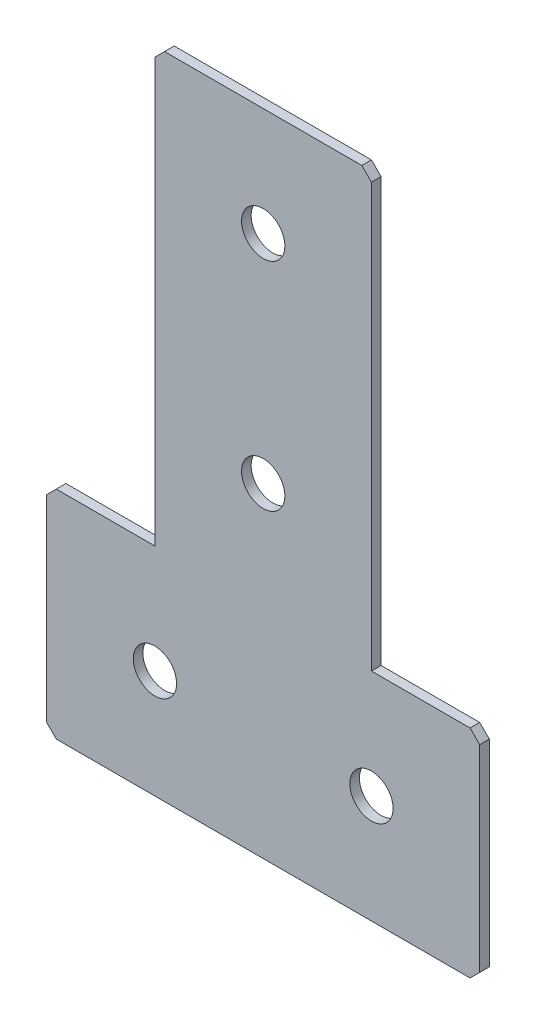
ISO-10303-21;
HEADER;
FILE_DESCRIPTION(('STEP AP214'),'2;1');
FILE_NAME('part.step','',(''),(''),'','','');
FILE_SCHEMA(('AUTOMOTIVE_DESIGN { 1 0 10303 214 1 1 1 1 }'));
ENDSEC;
DATA;
#1=APPLICATION_CONTEXT('core data for automotive mechanical design processes');
#2=APPLICATION_PROTOCOL_DEFINITION('international standard','automotive_design',2000,#1);
#3=PRODUCT_CONTEXT('',#1,'mechanical');
#4=PRODUCT('Part','Part','',(#3));
#5=PRODUCT_RELATED_PRODUCT_CATEGORY('part','',(#4));
#6=PRODUCT_DEFINITION_FORMATION('','',#4);
#7=PRODUCT_DEFINITION_CONTEXT('part definition',#1,'design');
#8=PRODUCT_DEFINITION('design','',#6,#7);
#9=PRODUCT_DEFINITION_SHAPE('','',#8);
#10=(LENGTH_UNIT() NAMED_UNIT(*) SI_UNIT(.MILLI.,.METRE.));
#11=(NAMED_UNIT(*) PLANE_ANGLE_UNIT() SI_UNIT($,.RADIAN.));
#12=(NAMED_UNIT(*) SI_UNIT($,.STERADIAN.) SOLID_ANGLE_UNIT());
#13=UNCERTAINTY_MEASURE_WITH_UNIT(LENGTH_MEASURE(1.E-05),#10,'distance_accuracy_value','');
#14=(GEOMETRIC_REPRESENTATION_CONTEXT(3) GLOBAL_UNCERTAINTY_ASSIGNED_CONTEXT((#13)) GLOBAL_UNIT_ASSIGNED_CONTEXT((#10,
#11,#12)) REPRESENTATION_CONTEXT('',''));
#15=CARTESIAN_POINT('',(0.,0.,0.));
#16=DIRECTION('',(0.,0.,1.));
#17=DIRECTION('',(1.,0.,0.));
#18=AXIS2_PLACEMENT_3D('',#15,#16,#17);
#19=CARTESIAN_POINT('',(-22.5,-90.,-2.));
#20=DIRECTION('',(1.,0.,0.));
#21=DIRECTION('',(0.,1.,0.));
#22=AXIS2_PLACEMENT_3D('',#19,#20,#21);
#23=PLANE('',#22);
#24=DIRECTION('',(0.,1.,0.));
#25=VECTOR('',#24,1.);
#26=CARTESIAN_POINT('',(-22.5,-90.,0.));
#27=LINE('',#26,#25);
#28=CARTESIAN_POINT('',(-22.5,-90.,0.));
#29=VERTEX_POINT('',#28);
#30=CARTESIAN_POINT('',(-22.5,-2.,0.));
#31=VERTEX_POINT('',#30);
#32=EDGE_CURVE('E178',#29,#31,#27,.T.);
#33=ORIENTED_EDGE('',*,*,#32,.T.);
#34=DIRECTION('',(0.,0.,-1.));
#35=VECTOR('',#34,1.);
#36=CARTESIAN_POINT('',(-22.5,-1.99999999999997,-2.));
#37=LINE('',#36,#35);
#38=CARTESIAN_POINT('',(-22.5,-2.,-2.));
#39=VERTEX_POINT('',#38);
#40=EDGE_CURVE('E240',#31,#39,#37,.T.);
#41=ORIENTED_EDGE('',*,*,#40,.T.);
#42=DIRECTION('',(0.,1.,0.));
#43=VECTOR('',#42,1.);
#44=CARTESIAN_POINT('',(-22.5,-90.,-2.));
#45=LINE('',#44,#43);
#46=CARTESIAN_POINT('',(-22.5,-90.,-2.));
#47=VERTEX_POINT('',#46);
#48=EDGE_CURVE('E198',#47,#39,#45,.T.);
#49=ORIENTED_EDGE('',*,*,#48,.F.);
#50=DIRECTION('',(0.,0.,1.));
#51=VECTOR('',#50,1.);
#52=CARTESIAN_POINT('',(-22.5,-90.,-2.));
#53=LINE('',#52,#51);
#54=EDGE_CURVE('E163',#47,#29,#53,.T.);
#55=ORIENTED_EDGE('',*,*,#54,.T.);
#56=EDGE_LOOP('',(#33,#41,#49,#55));
#57=FACE_BOUND('',#56,.T.);
#58=ADVANCED_FACE('F37',(#57),#23,.F.);
#59=CARTESIAN_POINT('',(22.5,0.,-2.));
#60=DIRECTION('',(0.,-1.,0.));
#61=DIRECTION('',(1.,0.,0.));
#62=AXIS2_PLACEMENT_3D('',#59,#60,#61);
#63=PLANE('',#62);
#64=DIRECTION('',(1.,0.,0.));
#65=VECTOR('',#64,1.);
#66=CARTESIAN_POINT('',(22.5,0.,-2.));
#67=LINE('',#66,#65);
#68=CARTESIAN_POINT('',(-20.5,0.,-2.));
#69=VERTEX_POINT('',#68);
#70=CARTESIAN_POINT('',(20.5,0.,-2.));
#71=VERTEX_POINT('',#70);
#72=EDGE_CURVE('E152',#69,#71,#67,.T.);
#73=ORIENTED_EDGE('',*,*,#72,.F.);
#74=DIRECTION('',(0.,0.,1.));
#75=VECTOR('',#74,1.);
#76=CARTESIAN_POINT('',(-20.5,0.,-2.));
#77=LINE('',#76,#75);
#78=CARTESIAN_POINT('',(-20.5,0.,0.));
#79=VERTEX_POINT('',#78);
#80=EDGE_CURVE('E237',#69,#79,#77,.T.);
#81=ORIENTED_EDGE('',*,*,#80,.T.);
#82=DIRECTION('',(1.,0.,0.));
#83=VECTOR('',#82,1.);
#84=CARTESIAN_POINT('',(22.5,0.,0.));
#85=LINE('',#84,#83);
#86=CARTESIAN_POINT('',(20.5,0.,0.));
#87=VERTEX_POINT('',#86);
#88=EDGE_CURVE('E181',#79,#87,#85,.T.);
#89=ORIENTED_EDGE('',*,*,#88,.T.);
#90=DIRECTION('',(0.,0.,-1.));
#91=VECTOR('',#90,1.);
#92=CARTESIAN_POINT('',(20.5,0.,-2.));
#93=LINE('',#92,#91);
#94=EDGE_CURVE('E235',#87,#71,#93,.T.);
#95=ORIENTED_EDGE('',*,*,#94,.T.);
#96=EDGE_LOOP('',(#73,#81,#89,#95));
#97=FACE_BOUND('',#96,.T.);
#98=ADVANCED_FACE('F288',(#97),#63,.F.);
#99=CARTESIAN_POINT('',(22.5,-90.,-2.));
#100=DIRECTION('',(-1.,0.,0.));
#101=DIRECTION('',(0.,-1.,0.));
#102=AXIS2_PLACEMENT_3D('',#99,#100,#101);
#103=PLANE('',#102);
#104=DIRECTION('',(0.,-1.,0.));
#105=VECTOR('',#104,1.);
#106=CARTESIAN_POINT('',(22.5,-90.,-2.));
#107=LINE('',#106,#105);
#108=CARTESIAN_POINT('',(22.5,-2.00000000000002,-2.));
#109=VERTEX_POINT('',#108);
#110=CARTESIAN_POINT('',(22.5,-90.,-2.));
#111=VERTEX_POINT('',#110);
#112=EDGE_CURVE('E139',#109,#111,#107,.T.);
#113=ORIENTED_EDGE('',*,*,#112,.F.);
#114=DIRECTION('',(0.,0.,1.));
#115=VECTOR('',#114,1.);
#116=CARTESIAN_POINT('',(22.5,-1.99999999999999,-2.));
#117=LINE('',#116,#115);
#118=CARTESIAN_POINT('',(22.5,-2.00000000000002,0.));
#119=VERTEX_POINT('',#118);
#120=EDGE_CURVE('E242',#109,#119,#117,.T.);
#121=ORIENTED_EDGE('',*,*,#120,.T.);
#122=DIRECTION('',(0.,-1.,0.));
#123=VECTOR('',#122,1.);
#124=CARTESIAN_POINT('',(22.5,-90.,0.));
#125=LINE('',#124,#123);
#126=CARTESIAN_POINT('',(22.5,-90.,0.));
#127=VERTEX_POINT('',#126);
#128=EDGE_CURVE('E158',#119,#127,#125,.T.);
#129=ORIENTED_EDGE('',*,*,#128,.T.);
#130=DIRECTION('',(0.,0.,1.));
#131=VECTOR('',#130,1.);
#132=CARTESIAN_POINT('',(22.5,-90.,-2.));
#133=LINE('',#132,#131);
#134=EDGE_CURVE('E155',#111,#127,#133,.T.);
#135=ORIENTED_EDGE('',*,*,#134,.F.);
#136=EDGE_LOOP('',(#113,#121,#129,#135));
#137=FACE_BOUND('',#136,.T.);
#138=ADVANCED_FACE('F156',(#137),#103,.F.);
#139=CARTESIAN_POINT('',(45.,-90.,-2.));
#140=DIRECTION('',(0.,-1.,0.));
#141=DIRECTION('',(1.,0.,0.));
#142=AXIS2_PLACEMENT_3D('',#139,#140,#141);
#143=PLANE('',#142);
#144=DIRECTION('',(1.,0.,0.));
#145=VECTOR('',#144,1.);
#146=CARTESIAN_POINT('',(45.,-90.,0.));
#147=LINE('',#146,#145);
#148=CARTESIAN_POINT('',(43.,-90.,0.));
#149=VERTEX_POINT('',#148);
#150=EDGE_CURVE('E186',#127,#149,#147,.T.);
#151=ORIENTED_EDGE('',*,*,#150,.T.);
#152=DIRECTION('',(0.,0.,-1.));
#153=VECTOR('',#152,1.);
#154=CARTESIAN_POINT('',(43.,-90.,-2.));
#155=LINE('',#154,#153);
#156=CARTESIAN_POINT('',(43.,-90.,-2.));
#157=VERTEX_POINT('',#156);
#158=EDGE_CURVE('E11',#149,#157,#155,.T.);
#159=ORIENTED_EDGE('',*,*,#158,.T.);
#160=DIRECTION('',(1.,0.,0.));
#161=VECTOR('',#160,1.);
#162=CARTESIAN_POINT('',(45.,-90.,-2.));
#163=LINE('',#162,#161);
#164=EDGE_CURVE('E144',#111,#157,#163,.T.);
#165=ORIENTED_EDGE('',*,*,#164,.F.);
#166=ORIENTED_EDGE('',*,*,#134,.T.);
#167=EDGE_LOOP('',(#151,#159,#165,#166));
#168=FACE_BOUND('',#167,.T.);
#169=ADVANCED_FACE('F165',(#168),#143,.F.);
#170=CARTESIAN_POINT('',(45.,-135.,-2.));
#171=DIRECTION('',(-1.,0.,0.));
#172=DIRECTION('',(0.,0.,1.));
#173=AXIS2_PLACEMENT_3D('',#170,#171,#172);
#174=PLANE('',#173);
#175=DIRECTION('',(0.,-1.,0.));
#176=VECTOR('',#175,1.);
#177=CARTESIAN_POINT('',(45.,-135.,-2.));
#178=LINE('',#177,#176);
#179=CARTESIAN_POINT('',(45.,-92.,-2.));
#180=VERTEX_POINT('',#179);
#181=CARTESIAN_POINT('',(45.,-133.,-2.));
#182=VERTEX_POINT('',#181);
#183=EDGE_CURVE('E167',#180,#182,#178,.T.);
#184=ORIENTED_EDGE('',*,*,#183,.F.);
#185=DIRECTION('',(0.,0.,1.));
#186=VECTOR('',#185,1.);
#187=CARTESIAN_POINT('',(45.,-92.,-2.));
#188=LINE('',#187,#186);
#189=CARTESIAN_POINT('',(45.,-92.,0.));
#190=VERTEX_POINT('',#189);
#191=EDGE_CURVE('E45',#180,#190,#188,.T.);
#192=ORIENTED_EDGE('',*,*,#191,.T.);
#193=DIRECTION('',(0.,-1.,0.));
#194=VECTOR('',#193,1.);
#195=CARTESIAN_POINT('',(45.,-135.,0.));
#196=LINE('',#195,#194);
#197=CARTESIAN_POINT('',(45.,-133.,0.));
#198=VERTEX_POINT('',#197);
#199=EDGE_CURVE('E188',#190,#198,#196,.T.);
#200=ORIENTED_EDGE('',*,*,#199,.T.);
#201=DIRECTION('',(0.,0.,-1.));
#202=VECTOR('',#201,1.);
#203=CARTESIAN_POINT('',(45.,-133.,-2.));
#204=LINE('',#203,#202);
#205=EDGE_CURVE('E60',#198,#182,#204,.T.);
#206=ORIENTED_EDGE('',*,*,#205,.T.);
#207=EDGE_LOOP('',(#184,#192,#200,#206));
#208=FACE_BOUND('',#207,.T.);
#209=ADVANCED_FACE('F247',(#208),#174,.F.);
#210=CARTESIAN_POINT('',(-45.,-135.,-2.));
#211=DIRECTION('',(0.,1.,0.));
#212=DIRECTION('',(0.,0.,1.));
#213=AXIS2_PLACEMENT_3D('',#210,#211,#212);
#214=PLANE('',#213);
#215=DIRECTION('',(-1.,0.,0.));
#216=VECTOR('',#215,1.);
#217=CARTESIAN_POINT('',(-45.,-135.,0.));
#218=LINE('',#217,#216);
#219=CARTESIAN_POINT('',(43.,-135.,0.));
#220=VERTEX_POINT('',#219);
#221=CARTESIAN_POINT('',(-43.,-135.,0.));
#222=VERTEX_POINT('',#221);
#223=EDGE_CURVE('E190',#220,#222,#218,.T.);
#224=ORIENTED_EDGE('',*,*,#223,.T.);
#225=DIRECTION('',(0.,0.,-1.));
#226=VECTOR('',#225,1.);
#227=CARTESIAN_POINT('',(-43.,-135.,-2.));
#228=LINE('',#227,#226);
#229=CARTESIAN_POINT('',(-43.,-135.,-2.));
#230=VERTEX_POINT('',#229);
#231=EDGE_CURVE('E220',#222,#230,#228,.T.);
#232=ORIENTED_EDGE('',*,*,#231,.T.);
#233=DIRECTION('',(-1.,0.,0.));
#234=VECTOR('',#233,1.);
#235=CARTESIAN_POINT('',(-45.,-135.,-2.));
#236=LINE('',#235,#234);
#237=CARTESIAN_POINT('',(43.,-135.,-2.));
#238=VERTEX_POINT('',#237);
#239=EDGE_CURVE('E169',#238,#230,#236,.T.);
#240=ORIENTED_EDGE('',*,*,#239,.F.);
#241=DIRECTION('',(0.,0.,1.));
#242=VECTOR('',#241,1.);
#243=CARTESIAN_POINT('',(43.,-135.,-2.));
#244=LINE('',#243,#242);
#245=EDGE_CURVE('E217',#238,#220,#244,.T.);
#246=ORIENTED_EDGE('',*,*,#245,.T.);
#247=EDGE_LOOP('',(#224,#232,#240,#246));
#248=FACE_BOUND('',#247,.T.);
#249=ADVANCED_FACE('F258',(#248),#214,.F.);
#250=CARTESIAN_POINT('',(-45.,-135.,-2.));
#251=DIRECTION('',(1.,0.,0.));
#252=DIRECTION('',(0.,1.,0.));
#253=AXIS2_PLACEMENT_3D('',#250,#251,#252);
#254=PLANE('',#253);
#255=DIRECTION('',(0.,1.,0.));
#256=VECTOR('',#255,1.);
#257=CARTESIAN_POINT('',(-45.,-135.,-2.));
#258=LINE('',#257,#256);
#259=CARTESIAN_POINT('',(-45.,-133.,-2.));
#260=VERTEX_POINT('',#259);
#261=CARTESIAN_POINT('',(-45.,-92.,-2.));
#262=VERTEX_POINT('',#261);
#263=EDGE_CURVE('E174',#260,#262,#258,.T.);
#264=ORIENTED_EDGE('',*,*,#263,.F.);
#265=DIRECTION('',(0.,0.,1.));
#266=VECTOR('',#265,1.);
#267=CARTESIAN_POINT('',(-45.,-133.,-2.));
#268=LINE('',#267,#266);
#269=CARTESIAN_POINT('',(-45.,-133.,0.));
#270=VERTEX_POINT('',#269);
#271=EDGE_CURVE('E202',#260,#270,#268,.T.);
#272=ORIENTED_EDGE('',*,*,#271,.T.);
#273=DIRECTION('',(0.,1.,0.));
#274=VECTOR('',#273,1.);
#275=CARTESIAN_POINT('',(-45.,-135.,0.));
#276=LINE('',#275,#274);
#277=CARTESIAN_POINT('',(-45.,-92.,0.));
#278=VERTEX_POINT('',#277);
#279=EDGE_CURVE('E193',#270,#278,#276,.T.);
#280=ORIENTED_EDGE('',*,*,#279,.T.);
#281=DIRECTION('',(0.,0.,-1.));
#282=VECTOR('',#281,1.);
#283=CARTESIAN_POINT('',(-45.,-92.,-2.));
#284=LINE('',#283,#282);
#285=EDGE_CURVE('E162',#278,#262,#284,.T.);
#286=ORIENTED_EDGE('',*,*,#285,.T.);
#287=EDGE_LOOP('',(#264,#272,#280,#286));
#288=FACE_BOUND('',#287,.T.);
#289=ADVANCED_FACE('F266',(#288),#254,.F.);
#290=CARTESIAN_POINT('',(-45.,-90.,-2.));
#291=DIRECTION('',(0.,-1.,0.));
#292=DIRECTION('',(0.,0.,-1.));
#293=AXIS2_PLACEMENT_3D('',#290,#291,#292);
#294=PLANE('',#293);
#295=DIRECTION('',(1.,0.,0.));
#296=VECTOR('',#295,1.);
#297=CARTESIAN_POINT('',(-45.,-90.,-2.));
#298=LINE('',#297,#296);
#299=CARTESIAN_POINT('',(-43.,-90.,-2.));
#300=VERTEX_POINT('',#299);
#301=EDGE_CURVE('E176',#300,#47,#298,.T.);
#302=ORIENTED_EDGE('',*,*,#301,.F.);
#303=DIRECTION('',(0.,0.,1.));
#304=VECTOR('',#303,1.);
#305=CARTESIAN_POINT('',(-43.,-90.,-2.));
#306=LINE('',#305,#304);
#307=CARTESIAN_POINT('',(-43.,-90.,0.));
#308=VERTEX_POINT('',#307);
#309=EDGE_CURVE('E232',#300,#308,#306,.T.);
#310=ORIENTED_EDGE('',*,*,#309,.T.);
#311=DIRECTION('',(1.,0.,0.));
#312=VECTOR('',#311,1.);
#313=CARTESIAN_POINT('',(-45.,-90.,0.));
#314=LINE('',#313,#312);
#315=EDGE_CURVE('E196',#308,#29,#314,.T.);
#316=ORIENTED_EDGE('',*,*,#315,.T.);
#317=ORIENTED_EDGE('',*,*,#54,.F.);
#318=EDGE_LOOP('',(#302,#310,#316,#317));
#319=FACE_BOUND('',#318,.T.);
#320=ADVANCED_FACE('F274',(#319),#294,.F.);
#321=CARTESIAN_POINT('',(0.,0.,-2.));
#322=DIRECTION('',(0.,0.,1.));
#323=DIRECTION('',(1.,0.,0.));
#324=AXIS2_PLACEMENT_3D('',#321,#322,#323);
#325=PLANE('',#324);
#326=CARTESIAN_POINT('',(-22.5,-112.5,-2.00000000000001));
#327=DIRECTION('',(0.,0.,-1.));
#328=DIRECTION('',(0.,1.,0.));
#329=AXIS2_PLACEMENT_3D('',#326,#327,#328);
#330=CIRCLE('',#329,4.5);
#331=CARTESIAN_POINT('',(-22.5,-108.,-2.00000000000001));
#332=VERTEX_POINT('',#331);
#333=EDGE_CURVE('E313',#332,#332,#330,.T.);
#334=ORIENTED_EDGE('',*,*,#333,.F.);
#335=EDGE_LOOP('',(#334));
#336=FACE_BOUND('',#335,.T.);
#337=CARTESIAN_POINT('',(22.5,-112.5,-2.00000000000001));
#338=DIRECTION('',(0.,0.,-1.));
#339=DIRECTION('',(0.,1.,0.));
#340=AXIS2_PLACEMENT_3D('',#337,#338,#339);
#341=CIRCLE('',#340,4.5);
#342=CARTESIAN_POINT('',(22.5,-108.,-2.00000000000001));
#343=VERTEX_POINT('',#342);
#344=EDGE_CURVE('E307',#343,#343,#341,.T.);
#345=ORIENTED_EDGE('',*,*,#344,.F.);
#346=EDGE_LOOP('',(#345));
#347=FACE_BOUND('',#346,.T.);
#348=CARTESIAN_POINT('',(0.,-67.5,-2.));
#349=DIRECTION('',(0.,0.,-1.));
#350=DIRECTION('',(0.,1.,0.));
#351=AXIS2_PLACEMENT_3D('',#348,#349,#350);
#352=CIRCLE('',#351,4.5);
#353=CARTESIAN_POINT('',(0.,-63.,-2.));
#354=VERTEX_POINT('',#353);
#355=EDGE_CURVE('E301',#354,#354,#352,.T.);
#356=ORIENTED_EDGE('',*,*,#355,.F.);
#357=EDGE_LOOP('',(#356));
#358=FACE_BOUND('',#357,.T.);
#359=CARTESIAN_POINT('',(0.,-22.5,-2.));
#360=DIRECTION('',(0.,0.,-1.));
#361=DIRECTION('',(0.,1.,0.));
#362=AXIS2_PLACEMENT_3D('',#359,#360,#361);
#363=CIRCLE('',#362,4.5);
#364=CARTESIAN_POINT('',(0.,-18.,-2.));
#365=VERTEX_POINT('',#364);
#366=EDGE_CURVE('E295',#365,#365,#363,.T.);
#367=ORIENTED_EDGE('',*,*,#366,.F.);
#368=EDGE_LOOP('',(#367));
#369=FACE_BOUND('',#368,.T.);
#370=ORIENTED_EDGE('',*,*,#239,.T.);
#371=DIRECTION('',(0.707106781186548,-0.707106781186548,0.));
#372=VECTOR('',#371,1.);
#373=CARTESIAN_POINT('',(-45.,-133.,-2.));
#374=LINE('',#373,#372);
#375=EDGE_CURVE('E230',#230,#260,#374,.F.);
#376=ORIENTED_EDGE('',*,*,#375,.T.);
#377=ORIENTED_EDGE('',*,*,#263,.T.);
#378=DIRECTION('',(-0.707106781186548,-0.707106781186548,0.));
#379=VECTOR('',#378,1.);
#380=CARTESIAN_POINT('',(-43.,-90.,-2.));
#381=LINE('',#380,#379);
#382=EDGE_CURVE('E52',#262,#300,#381,.F.);
#383=ORIENTED_EDGE('',*,*,#382,.T.);
#384=ORIENTED_EDGE('',*,*,#301,.T.);
#385=ORIENTED_EDGE('',*,*,#48,.T.);
#386=DIRECTION('',(-0.707106781186547,-0.707106781186548,0.));
#387=VECTOR('',#386,1.);
#388=CARTESIAN_POINT('',(-20.5,0.,-2.));
#389=LINE('',#388,#387);
#390=EDGE_CURVE('E227',#39,#69,#389,.F.);
#391=ORIENTED_EDGE('',*,*,#390,.T.);
#392=ORIENTED_EDGE('',*,*,#72,.T.);
#393=DIRECTION('',(-0.707106781186549,0.707106781186546,0.));
#394=VECTOR('',#393,1.);
#395=CARTESIAN_POINT('',(22.5,-1.99999999999999,-2.));
#396=LINE('',#395,#394);
#397=EDGE_CURVE('E148',#71,#109,#396,.F.);
#398=ORIENTED_EDGE('',*,*,#397,.T.);
#399=ORIENTED_EDGE('',*,*,#112,.T.);
#400=ORIENTED_EDGE('',*,*,#164,.T.);
#401=DIRECTION('',(-0.707106781186545,0.70710678118655,0.));
#402=VECTOR('',#401,1.);
#403=CARTESIAN_POINT('',(45.,-92.,-2.));
#404=LINE('',#403,#402);
#405=EDGE_CURVE('E224',#157,#180,#404,.F.);
#406=ORIENTED_EDGE('',*,*,#405,.T.);
#407=ORIENTED_EDGE('',*,*,#183,.T.);
#408=DIRECTION('',(0.707106781186545,0.70710678118655,0.));
#409=VECTOR('',#408,1.);
#410=CARTESIAN_POINT('',(43.,-135.,-2.));
#411=LINE('',#410,#409);
#412=EDGE_CURVE('E222',#182,#238,#411,.F.);
#413=ORIENTED_EDGE('',*,*,#412,.T.);
#414=EDGE_LOOP('',(#370,#376,#377,#383,#384,#385,#391,#392,#398,#399,#400,#406,#407,#413));
#415=FACE_BOUND('',#414,.T.);
#416=ADVANCED_FACE('F142',(#336,#347,#358,#369,#415),#325,.F.);
#417=CARTESIAN_POINT('',(0.,0.,0.));
#418=DIRECTION('',(0.,0.,1.));
#419=DIRECTION('',(1.,0.,0.));
#420=AXIS2_PLACEMENT_3D('',#417,#418,#419);
#421=PLANE('',#420);
#422=CARTESIAN_POINT('',(-22.5,-112.5,0.));
#423=DIRECTION('',(0.,0.,-1.));
#424=DIRECTION('',(0.,1.,0.));
#425=AXIS2_PLACEMENT_3D('',#422,#423,#424);
#426=CIRCLE('',#425,4.5);
#427=CARTESIAN_POINT('',(-22.5,-108.,0.));
#428=VERTEX_POINT('',#427);
#429=EDGE_CURVE('E310',#428,#428,#426,.T.);
#430=ORIENTED_EDGE('',*,*,#429,.T.);
#431=EDGE_LOOP('',(#430));
#432=FACE_BOUND('',#431,.T.);
#433=CARTESIAN_POINT('',(22.5,-112.5,0.));
#434=DIRECTION('',(0.,0.,-1.));
#435=DIRECTION('',(0.,1.,0.));
#436=AXIS2_PLACEMENT_3D('',#433,#434,#435);
#437=CIRCLE('',#436,4.5);
#438=CARTESIAN_POINT('',(22.5,-108.,0.));
#439=VERTEX_POINT('',#438);
#440=EDGE_CURVE('E304',#439,#439,#437,.T.);
#441=ORIENTED_EDGE('',*,*,#440,.T.);
#442=EDGE_LOOP('',(#441));
#443=FACE_BOUND('',#442,.T.);
#444=CARTESIAN_POINT('',(0.,-67.5,0.));
#445=DIRECTION('',(0.,0.,-1.));
#446=DIRECTION('',(0.,1.,0.));
#447=AXIS2_PLACEMENT_3D('',#444,#445,#446);
#448=CIRCLE('',#447,4.5);
#449=CARTESIAN_POINT('',(0.,-63.,0.));
#450=VERTEX_POINT('',#449);
#451=EDGE_CURVE('E298',#450,#450,#448,.T.);
#452=ORIENTED_EDGE('',*,*,#451,.T.);
#453=EDGE_LOOP('',(#452));
#454=FACE_BOUND('',#453,.T.);
#455=CARTESIAN_POINT('',(0.,-22.5,0.));
#456=DIRECTION('',(0.,0.,-1.));
#457=DIRECTION('',(0.,1.,0.));
#458=AXIS2_PLACEMENT_3D('',#455,#456,#457);
#459=CIRCLE('',#458,4.5);
#460=CARTESIAN_POINT('',(0.,-18.,0.));
#461=VERTEX_POINT('',#460);
#462=EDGE_CURVE('E182',#461,#461,#459,.T.);
#463=ORIENTED_EDGE('',*,*,#462,.T.);
#464=EDGE_LOOP('',(#463));
#465=FACE_BOUND('',#464,.T.);
#466=ORIENTED_EDGE('',*,*,#279,.F.);
#467=DIRECTION('',(-0.707106781186548,0.707106781186548,0.));
#468=VECTOR('',#467,1.);
#469=CARTESIAN_POINT('',(-89.,-89.,0.));
#470=LINE('',#469,#468);
#471=EDGE_CURVE('E215',#270,#222,#470,.F.);
#472=ORIENTED_EDGE('',*,*,#471,.T.);
#473=ORIENTED_EDGE('',*,*,#223,.F.);
#474=DIRECTION('',(-0.707106781186545,-0.70710678118655,0.));
#475=VECTOR('',#474,1.);
#476=CARTESIAN_POINT('',(89.0000000000001,-88.9999999999995,0.));
#477=LINE('',#476,#475);
#478=EDGE_CURVE('E205',#220,#198,#477,.F.);
#479=ORIENTED_EDGE('',*,*,#478,.T.);
#480=ORIENTED_EDGE('',*,*,#199,.F.);
#481=DIRECTION('',(0.707106781186545,-0.70710678118655,0.));
#482=VECTOR('',#481,1.);
#483=CARTESIAN_POINT('',(-23.4999999999999,-23.4999999999997,0.));
#484=LINE('',#483,#482);
#485=EDGE_CURVE('E207',#190,#149,#484,.F.);
#486=ORIENTED_EDGE('',*,*,#485,.T.);
#487=ORIENTED_EDGE('',*,*,#150,.F.);
#488=ORIENTED_EDGE('',*,*,#128,.F.);
#489=DIRECTION('',(0.707106781186549,-0.707106781186546,0.));
#490=VECTOR('',#489,1.);
#491=CARTESIAN_POINT('',(10.25,10.25,0.));
#492=LINE('',#491,#490);
#493=EDGE_CURVE('E209',#119,#87,#492,.F.);
#494=ORIENTED_EDGE('',*,*,#493,.T.);
#495=ORIENTED_EDGE('',*,*,#88,.F.);
#496=DIRECTION('',(0.707106781186547,0.707106781186548,0.));
#497=VECTOR('',#496,1.);
#498=CARTESIAN_POINT('',(-10.25,10.25,0.));
#499=LINE('',#498,#497);
#500=EDGE_CURVE('E211',#79,#31,#499,.F.);
#501=ORIENTED_EDGE('',*,*,#500,.T.);
#502=ORIENTED_EDGE('',*,*,#32,.F.);
#503=ORIENTED_EDGE('',*,*,#315,.F.);
#504=DIRECTION('',(0.707106781186548,0.707106781186548,0.));
#505=VECTOR('',#504,1.);
#506=CARTESIAN_POINT('',(23.5,-23.5,0.));
#507=LINE('',#506,#505);
#508=EDGE_CURVE('E213',#308,#278,#507,.F.);
#509=ORIENTED_EDGE('',*,*,#508,.T.);
#510=EDGE_LOOP('',(#466,#472,#473,#479,#480,#486,#487,#488,#494,#495,#501,#502,#503,#509));
#511=FACE_BOUND('',#510,.T.);
#512=ADVANCED_FACE('F251',(#432,#443,#454,#465,#511),#421,.T.);
#513=CARTESIAN_POINT('',(0.,-22.5,-2.));
#514=DIRECTION('',(0.,0.,-1.));
#515=DIRECTION('',(0.,1.,0.));
#516=AXIS2_PLACEMENT_3D('',#513,#514,#515);
#517=CYLINDRICAL_SURFACE('',#516,4.5);
#518=ORIENTED_EDGE('',*,*,#462,.F.);
#519=EDGE_LOOP('',(#518));
#520=FACE_BOUND('',#519,.T.);
#521=ORIENTED_EDGE('',*,*,#366,.T.);
#522=EDGE_LOOP('',(#521));
#523=FACE_BOUND('',#522,.T.);
#524=ADVANCED_FACE('F328',(#520,#523),#517,.F.);
#525=CARTESIAN_POINT('',(0.,-67.5,-2.));
#526=DIRECTION('',(0.,0.,-1.));
#527=DIRECTION('',(0.,1.,0.));
#528=AXIS2_PLACEMENT_3D('',#525,#526,#527);
#529=CYLINDRICAL_SURFACE('',#528,4.5);
#530=ORIENTED_EDGE('',*,*,#451,.F.);
#531=EDGE_LOOP('',(#530));
#532=FACE_BOUND('',#531,.T.);
#533=ORIENTED_EDGE('',*,*,#355,.T.);
#534=EDGE_LOOP('',(#533));
#535=FACE_BOUND('',#534,.T.);
#536=ADVANCED_FACE('F330',(#532,#535),#529,.F.);
#537=CARTESIAN_POINT('',(22.5,-112.5,-2.00000000000001));
#538=DIRECTION('',(0.,0.,-1.));
#539=DIRECTION('',(0.,1.,0.));
#540=AXIS2_PLACEMENT_3D('',#537,#538,#539);
#541=CYLINDRICAL_SURFACE('',#540,4.5);
#542=ORIENTED_EDGE('',*,*,#440,.F.);
#543=EDGE_LOOP('',(#542));
#544=FACE_BOUND('',#543,.T.);
#545=ORIENTED_EDGE('',*,*,#344,.T.);
#546=EDGE_LOOP('',(#545));
#547=FACE_BOUND('',#546,.T.);
#548=ADVANCED_FACE('F337',(#544,#547),#541,.F.);
#549=CARTESIAN_POINT('',(-22.5,-112.5,-2.00000000000001));
#550=DIRECTION('',(0.,0.,-1.));
#551=DIRECTION('',(0.,1.,0.));
#552=AXIS2_PLACEMENT_3D('',#549,#550,#551);
#553=CYLINDRICAL_SURFACE('',#552,4.5);
#554=ORIENTED_EDGE('',*,*,#429,.F.);
#555=EDGE_LOOP('',(#554));
#556=FACE_BOUND('',#555,.T.);
#557=ORIENTED_EDGE('',*,*,#333,.T.);
#558=EDGE_LOOP('',(#557));
#559=FACE_BOUND('',#558,.T.);
#560=ADVANCED_FACE('F317',(#556,#559),#553,.F.);
#561=CARTESIAN_POINT('',(-45.,-133.,-2.));
#562=DIRECTION('',(0.707106781186547,0.707106781186547,0.));
#563=DIRECTION('',(0.,0.,1.));
#564=AXIS2_PLACEMENT_3D('',#561,#562,#563);
#565=PLANE('',#564);
#566=ORIENTED_EDGE('',*,*,#375,.F.);
#567=ORIENTED_EDGE('',*,*,#231,.F.);
#568=ORIENTED_EDGE('',*,*,#471,.F.);
#569=ORIENTED_EDGE('',*,*,#271,.F.);
#570=EDGE_LOOP('',(#566,#567,#568,#569));
#571=FACE_BOUND('',#570,.T.);
#572=ADVANCED_FACE('F264',(#571),#565,.F.);
#573=CARTESIAN_POINT('',(-43.,-90.,-2.));
#574=DIRECTION('',(0.707106781186547,-0.707106781186547,0.));
#575=DIRECTION('',(0.,0.,1.));
#576=AXIS2_PLACEMENT_3D('',#573,#574,#575);
#577=PLANE('',#576);
#578=ORIENTED_EDGE('',*,*,#382,.F.);
#579=ORIENTED_EDGE('',*,*,#285,.F.);
#580=ORIENTED_EDGE('',*,*,#508,.F.);
#581=ORIENTED_EDGE('',*,*,#309,.F.);
#582=EDGE_LOOP('',(#578,#579,#580,#581));
#583=FACE_BOUND('',#582,.T.);
#584=ADVANCED_FACE('F272',(#583),#577,.F.);
#585=CARTESIAN_POINT('',(-20.5,0.,-2.));
#586=DIRECTION('',(0.707106781186548,-0.707106781186547,0.));
#587=DIRECTION('',(0.,0.,1.));
#588=AXIS2_PLACEMENT_3D('',#585,#586,#587);
#589=PLANE('',#588);
#590=ORIENTED_EDGE('',*,*,#390,.F.);
#591=ORIENTED_EDGE('',*,*,#40,.F.);
#592=ORIENTED_EDGE('',*,*,#500,.F.);
#593=ORIENTED_EDGE('',*,*,#80,.F.);
#594=EDGE_LOOP('',(#590,#591,#592,#593));
#595=FACE_BOUND('',#594,.T.);
#596=ADVANCED_FACE('F285',(#595),#589,.F.);
#597=CARTESIAN_POINT('',(22.5,-1.99999999999999,-2.));
#598=DIRECTION('',(-0.707106781186546,-0.707106781186549,0.));
#599=DIRECTION('',(0.,0.,1.));
#600=AXIS2_PLACEMENT_3D('',#597,#598,#599);
#601=PLANE('',#600);
#602=ORIENTED_EDGE('',*,*,#397,.F.);
#603=ORIENTED_EDGE('',*,*,#94,.F.);
#604=ORIENTED_EDGE('',*,*,#493,.F.);
#605=ORIENTED_EDGE('',*,*,#120,.F.);
#606=EDGE_LOOP('',(#602,#603,#604,#605));
#607=FACE_BOUND('',#606,.T.);
#608=ADVANCED_FACE('F291',(#607),#601,.F.);
#609=CARTESIAN_POINT('',(45.,-92.,-2.));
#610=DIRECTION('',(-0.70710678118655,-0.707106781186545,0.));
#611=DIRECTION('',(0.,0.,1.));
#612=AXIS2_PLACEMENT_3D('',#609,#610,#611);
#613=PLANE('',#612);
#614=ORIENTED_EDGE('',*,*,#405,.F.);
#615=ORIENTED_EDGE('',*,*,#158,.F.);
#616=ORIENTED_EDGE('',*,*,#485,.F.);
#617=ORIENTED_EDGE('',*,*,#191,.F.);
#618=EDGE_LOOP('',(#614,#615,#616,#617));
#619=FACE_BOUND('',#618,.T.);
#620=ADVANCED_FACE('F358',(#619),#613,.F.);
#621=CARTESIAN_POINT('',(43.,-135.,-2.));
#622=DIRECTION('',(-0.70710678118655,0.707106781186545,0.));
#623=DIRECTION('',(0.,0.,1.));
#624=AXIS2_PLACEMENT_3D('',#621,#622,#623);
#625=PLANE('',#624);
#626=ORIENTED_EDGE('',*,*,#412,.F.);
#627=ORIENTED_EDGE('',*,*,#205,.F.);
#628=ORIENTED_EDGE('',*,*,#478,.F.);
#629=ORIENTED_EDGE('',*,*,#245,.F.);
#630=EDGE_LOOP('',(#626,#627,#628,#629));
#631=FACE_BOUND('',#630,.T.);
#632=ADVANCED_FACE('F39',(#631),#625,.F.);
#633=CLOSED_SHELL('',(#58,#98,#138,#169,#209,#249,#289,#320,#416,#512,#524,#536,#548,#560,#572,
#584,#596,#608,#620,#632));
#634=MANIFOLD_SOLID_BREP('B2',#633);
#635=ADVANCED_BREP_SHAPE_REPRESENTATION('',(#18,#634),#14);
#636=SHAPE_DEFINITION_REPRESENTATION(#9,#635);
ENDSEC;
END-ISO-10303-21;
